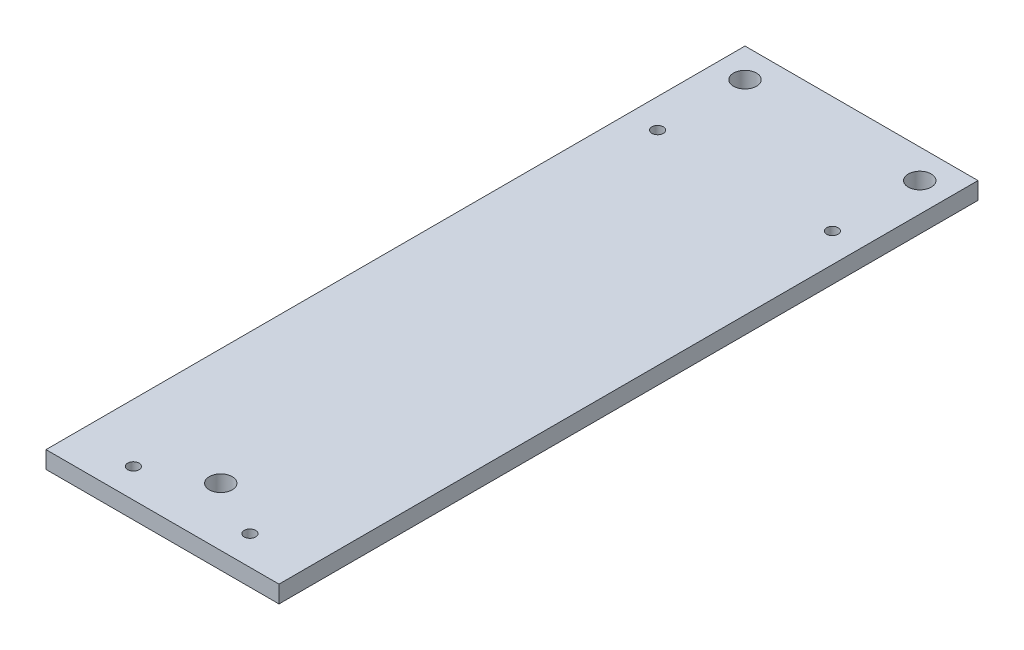
ISO-10303-21;
HEADER;
FILE_DESCRIPTION(('STEP AP214'),'2;1');
FILE_NAME('part.step','',(''),(''),'','','');
FILE_SCHEMA(('AUTOMOTIVE_DESIGN { 1 0 10303 214 1 1 1 1 }'));
ENDSEC;
DATA;
#1=APPLICATION_CONTEXT('core data for automotive mechanical design processes');
#2=APPLICATION_PROTOCOL_DEFINITION('international standard','automotive_design',2000,#1);
#3=PRODUCT_CONTEXT('',#1,'mechanical');
#4=PRODUCT('Part','Part','',(#3));
#5=PRODUCT_RELATED_PRODUCT_CATEGORY('part','',(#4));
#6=PRODUCT_DEFINITION_FORMATION('','',#4);
#7=PRODUCT_DEFINITION_CONTEXT('part definition',#1,'design');
#8=PRODUCT_DEFINITION('design','',#6,#7);
#9=PRODUCT_DEFINITION_SHAPE('','',#8);
#10=(LENGTH_UNIT() NAMED_UNIT(*) SI_UNIT(.MILLI.,.METRE.));
#11=(NAMED_UNIT(*) PLANE_ANGLE_UNIT() SI_UNIT($,.RADIAN.));
#12=(NAMED_UNIT(*) SI_UNIT($,.STERADIAN.) SOLID_ANGLE_UNIT());
#13=UNCERTAINTY_MEASURE_WITH_UNIT(LENGTH_MEASURE(1.E-05),#10,'distance_accuracy_value','');
#14=(GEOMETRIC_REPRESENTATION_CONTEXT(3) GLOBAL_UNCERTAINTY_ASSIGNED_CONTEXT((#13)) GLOBAL_UNIT_ASSIGNED_CONTEXT((#10,
#11,#12)) REPRESENTATION_CONTEXT('',''));
#15=CARTESIAN_POINT('',(0.,0.,0.));
#16=DIRECTION('',(0.,0.,1.));
#17=DIRECTION('',(1.,0.,0.));
#18=AXIS2_PLACEMENT_3D('',#15,#16,#17);
#19=CARTESIAN_POINT('',(45.72,1.5,0.));
#20=DIRECTION('',(1.,0.,0.));
#21=DIRECTION('',(0.,0.,-1.));
#22=AXIS2_PLACEMENT_3D('',#19,#20,#21);
#23=PLANE('',#22);
#24=DIRECTION('',(0.,0.,1.));
#25=VECTOR('',#24,1.);
#26=CARTESIAN_POINT('',(45.72,0.,0.));
#27=LINE('',#26,#25);
#28=CARTESIAN_POINT('',(45.72,0.,15.24));
#29=VERTEX_POINT('',#28);
#30=CARTESIAN_POINT('',(45.72,0.,76.2));
#31=VERTEX_POINT('',#30);
#32=EDGE_CURVE('E121',#29,#31,#27,.T.);
#33=ORIENTED_EDGE('',*,*,#32,.F.);
#34=DIRECTION('',(0.,-1.,0.));
#35=VECTOR('',#34,1.);
#36=CARTESIAN_POINT('',(45.72,1.5,15.24));
#37=LINE('',#36,#35);
#38=CARTESIAN_POINT('',(45.72,1.5,15.24));
#39=VERTEX_POINT('',#38);
#40=EDGE_CURVE('E11',#39,#29,#37,.T.);
#41=ORIENTED_EDGE('',*,*,#40,.F.);
#42=DIRECTION('',(0.,0.,1.));
#43=VECTOR('',#42,1.);
#44=CARTESIAN_POINT('',(45.72,1.5,0.));
#45=LINE('',#44,#43);
#46=CARTESIAN_POINT('',(45.72,1.5,76.2));
#47=VERTEX_POINT('',#46);
#48=EDGE_CURVE('E92',#39,#47,#45,.T.);
#49=ORIENTED_EDGE('',*,*,#48,.T.);
#50=DIRECTION('',(0.,-1.,0.));
#51=VECTOR('',#50,1.);
#52=CARTESIAN_POINT('',(45.72,1.5,76.2));
#53=LINE('',#52,#51);
#54=EDGE_CURVE('E52',#47,#31,#53,.T.);
#55=ORIENTED_EDGE('',*,*,#54,.T.);
#56=EDGE_LOOP('',(#33,#41,#49,#55));
#57=FACE_BOUND('',#56,.T.);
#58=ADVANCED_FACE('F35',(#57),#23,.T.);
#59=CARTESIAN_POINT('',(0.,1.5,15.24));
#60=DIRECTION('',(0.,0.,-1.));
#61=DIRECTION('',(-1.,0.,0.));
#62=AXIS2_PLACEMENT_3D('',#59,#60,#61);
#63=PLANE('',#62);
#64=DIRECTION('',(1.,0.,0.));
#65=VECTOR('',#64,1.);
#66=CARTESIAN_POINT('',(0.,0.,15.24));
#67=LINE('',#66,#65);
#68=CARTESIAN_POINT('',(25.4,0.,15.24));
#69=VERTEX_POINT('',#68);
#70=EDGE_CURVE('E82',#69,#29,#67,.T.);
#71=ORIENTED_EDGE('',*,*,#70,.F.);
#72=DIRECTION('',(0.,-1.,0.));
#73=VECTOR('',#72,1.);
#74=CARTESIAN_POINT('',(25.4,1.5,15.24));
#75=LINE('',#74,#73);
#76=CARTESIAN_POINT('',(25.4,1.5,15.24));
#77=VERTEX_POINT('',#76);
#78=EDGE_CURVE('E44',#77,#69,#75,.T.);
#79=ORIENTED_EDGE('',*,*,#78,.F.);
#80=DIRECTION('',(1.,0.,0.));
#81=VECTOR('',#80,1.);
#82=CARTESIAN_POINT('',(0.,1.5,15.24));
#83=LINE('',#82,#81);
#84=EDGE_CURVE('E80',#77,#39,#83,.T.);
#85=ORIENTED_EDGE('',*,*,#84,.T.);
#86=ORIENTED_EDGE('',*,*,#40,.T.);
#87=EDGE_LOOP('',(#71,#79,#85,#86));
#88=FACE_BOUND('',#87,.T.);
#89=ADVANCED_FACE('F79',(#88),#63,.T.);
#90=CARTESIAN_POINT('',(25.4,1.5,0.));
#91=DIRECTION('',(-1.,0.,0.));
#92=DIRECTION('',(0.,0.,1.));
#93=AXIS2_PLACEMENT_3D('',#90,#91,#92);
#94=PLANE('',#93);
#95=DIRECTION('',(0.,0.,-1.));
#96=VECTOR('',#95,1.);
#97=CARTESIAN_POINT('',(25.4,0.,0.));
#98=LINE('',#97,#96);
#99=CARTESIAN_POINT('',(25.4,0.,76.2));
#100=VERTEX_POINT('',#99);
#101=EDGE_CURVE('E124',#100,#69,#98,.T.);
#102=ORIENTED_EDGE('',*,*,#101,.F.);
#103=DIRECTION('',(0.,-1.,0.));
#104=VECTOR('',#103,1.);
#105=CARTESIAN_POINT('',(25.4,1.5,76.2));
#106=LINE('',#105,#104);
#107=CARTESIAN_POINT('',(25.4,1.5,76.2));
#108=VERTEX_POINT('',#107);
#109=EDGE_CURVE('E65',#108,#100,#106,.T.);
#110=ORIENTED_EDGE('',*,*,#109,.F.);
#111=DIRECTION('',(0.,0.,-1.));
#112=VECTOR('',#111,1.);
#113=CARTESIAN_POINT('',(25.4,1.5,0.));
#114=LINE('',#113,#112);
#115=EDGE_CURVE('E91',#108,#77,#114,.T.);
#116=ORIENTED_EDGE('',*,*,#115,.T.);
#117=ORIENTED_EDGE('',*,*,#78,.T.);
#118=EDGE_LOOP('',(#102,#110,#116,#117));
#119=FACE_BOUND('',#118,.T.);
#120=ADVANCED_FACE('F94',(#119),#94,.T.);
#121=CARTESIAN_POINT('',(30.48,1.5,73.66));
#122=DIRECTION('',(0.,-1.,0.));
#123=DIRECTION('',(0.,0.,-1.));
#124=AXIS2_PLACEMENT_3D('',#121,#122,#123);
#125=CYLINDRICAL_SURFACE('',#124,0.499999999999999);
#126=CARTESIAN_POINT('',(30.48,1.5,73.66));
#127=DIRECTION('',(0.,1.,0.));
#128=DIRECTION('',(0.,0.,1.));
#129=AXIS2_PLACEMENT_3D('',#126,#127,#128);
#130=CIRCLE('',#129,0.499999999999999);
#131=CARTESIAN_POINT('',(30.48,1.5,74.16));
#132=VERTEX_POINT('',#131);
#133=EDGE_CURVE('E106',#132,#132,#130,.T.);
#134=ORIENTED_EDGE('',*,*,#133,.T.);
#135=EDGE_LOOP('',(#134));
#136=FACE_BOUND('',#135,.T.);
#137=CARTESIAN_POINT('',(30.48,0.,73.66));
#138=DIRECTION('',(0.,1.,0.));
#139=DIRECTION('',(0.,0.,1.));
#140=AXIS2_PLACEMENT_3D('',#137,#138,#139);
#141=CIRCLE('',#140,0.499999999999999);
#142=CARTESIAN_POINT('',(30.48,0.,74.16));
#143=VERTEX_POINT('',#142);
#144=EDGE_CURVE('E135',#143,#143,#141,.T.);
#145=ORIENTED_EDGE('',*,*,#144,.F.);
#146=EDGE_LOOP('',(#145));
#147=FACE_BOUND('',#146,.T.);
#148=ADVANCED_FACE('F203',(#136,#147),#125,.F.);
#149=CARTESIAN_POINT('',(27.94,1.5,25.4));
#150=DIRECTION('',(0.,-1.,0.));
#151=DIRECTION('',(0.,0.,-1.));
#152=AXIS2_PLACEMENT_3D('',#149,#150,#151);
#153=CYLINDRICAL_SURFACE('',#152,0.499999999999999);
#154=CARTESIAN_POINT('',(27.94,1.5,25.4));
#155=DIRECTION('',(0.,1.,0.));
#156=DIRECTION('',(0.,0.,1.));
#157=AXIS2_PLACEMENT_3D('',#154,#155,#156);
#158=CIRCLE('',#157,0.499999999999999);
#159=CARTESIAN_POINT('',(27.94,1.5,25.9));
#160=VERTEX_POINT('',#159);
#161=EDGE_CURVE('E103',#160,#160,#158,.F.);
#162=ORIENTED_EDGE('',*,*,#161,.F.);
#163=EDGE_LOOP('',(#162));
#164=FACE_BOUND('',#163,.T.);
#165=CARTESIAN_POINT('',(27.94,0.,25.4));
#166=DIRECTION('',(0.,1.,0.));
#167=DIRECTION('',(0.,0.,1.));
#168=AXIS2_PLACEMENT_3D('',#165,#166,#167);
#169=CIRCLE('',#168,0.499999999999999);
#170=CARTESIAN_POINT('',(27.94,0.,25.9));
#171=VERTEX_POINT('',#170);
#172=EDGE_CURVE('E132',#171,#171,#169,.F.);
#173=ORIENTED_EDGE('',*,*,#172,.T.);
#174=EDGE_LOOP('',(#173));
#175=FACE_BOUND('',#174,.T.);
#176=ADVANCED_FACE('F167',(#164,#175),#153,.F.);
#177=CARTESIAN_POINT('',(27.94,1.5,17.78));
#178=DIRECTION('',(0.,-1.,0.));
#179=DIRECTION('',(0.,0.,-1.));
#180=AXIS2_PLACEMENT_3D('',#177,#178,#179);
#181=CYLINDRICAL_SURFACE('',#180,0.999999999999998);
#182=CARTESIAN_POINT('',(27.94,1.5,17.78));
#183=DIRECTION('',(0.,1.,0.));
#184=DIRECTION('',(0.,0.,1.));
#185=AXIS2_PLACEMENT_3D('',#182,#183,#184);
#186=CIRCLE('',#185,0.999999999999998);
#187=CARTESIAN_POINT('',(27.94,1.5,18.78));
#188=VERTEX_POINT('',#187);
#189=EDGE_CURVE('E97',#188,#188,#186,.T.);
#190=ORIENTED_EDGE('',*,*,#189,.T.);
#191=EDGE_LOOP('',(#190));
#192=FACE_BOUND('',#191,.T.);
#193=CARTESIAN_POINT('',(27.94,0.,17.78));
#194=DIRECTION('',(0.,1.,0.));
#195=DIRECTION('',(0.,0.,1.));
#196=AXIS2_PLACEMENT_3D('',#193,#194,#195);
#197=CIRCLE('',#196,0.999999999999998);
#198=CARTESIAN_POINT('',(27.94,0.,18.78));
#199=VERTEX_POINT('',#198);
#200=EDGE_CURVE('E129',#199,#199,#197,.T.);
#201=ORIENTED_EDGE('',*,*,#200,.F.);
#202=EDGE_LOOP('',(#201));
#203=FACE_BOUND('',#202,.T.);
#204=ADVANCED_FACE('F158',(#192,#203),#181,.F.);
#205=CARTESIAN_POINT('',(0.,1.5,76.2));
#206=DIRECTION('',(0.,0.,1.));
#207=DIRECTION('',(1.,0.,0.));
#208=AXIS2_PLACEMENT_3D('',#205,#206,#207);
#209=PLANE('',#208);
#210=DIRECTION('',(-1.,0.,0.));
#211=VECTOR('',#210,1.);
#212=CARTESIAN_POINT('',(0.,0.,76.2));
#213=LINE('',#212,#211);
#214=EDGE_CURVE('E126',#31,#100,#213,.T.);
#215=ORIENTED_EDGE('',*,*,#214,.F.);
#216=ORIENTED_EDGE('',*,*,#54,.F.);
#217=DIRECTION('',(-1.,0.,0.));
#218=VECTOR('',#217,1.);
#219=CARTESIAN_POINT('',(0.,1.5,76.2));
#220=LINE('',#219,#218);
#221=EDGE_CURVE('E95',#47,#108,#220,.T.);
#222=ORIENTED_EDGE('',*,*,#221,.T.);
#223=ORIENTED_EDGE('',*,*,#109,.T.);
#224=EDGE_LOOP('',(#215,#216,#222,#223));
#225=FACE_BOUND('',#224,.T.);
#226=ADVANCED_FACE('F155',(#225),#209,.T.);
#227=CARTESIAN_POINT('',(35.5600000000001,1.5,71.12));
#228=DIRECTION('',(0.,-1.,0.));
#229=DIRECTION('',(0.,0.,-1.));
#230=AXIS2_PLACEMENT_3D('',#227,#228,#229);
#231=CYLINDRICAL_SURFACE('',#230,0.999999999999998);
#232=CARTESIAN_POINT('',(35.5600000000001,1.5,71.12));
#233=DIRECTION('',(0.,1.,0.));
#234=DIRECTION('',(0.,0.,1.));
#235=AXIS2_PLACEMENT_3D('',#232,#233,#234);
#236=CIRCLE('',#235,0.999999999999998);
#237=CARTESIAN_POINT('',(35.5600000000001,1.5,72.12));
#238=VERTEX_POINT('',#237);
#239=EDGE_CURVE('E151',#238,#238,#236,.F.);
#240=ORIENTED_EDGE('',*,*,#239,.F.);
#241=EDGE_LOOP('',(#240));
#242=FACE_BOUND('',#241,.T.);
#243=CARTESIAN_POINT('',(35.5600000000001,0.,71.12));
#244=DIRECTION('',(0.,1.,0.));
#245=DIRECTION('',(0.,0.,1.));
#246=AXIS2_PLACEMENT_3D('',#243,#244,#245);
#247=CIRCLE('',#246,0.999999999999998);
#248=CARTESIAN_POINT('',(35.5600000000001,0.,72.12));
#249=VERTEX_POINT('',#248);
#250=EDGE_CURVE('E118',#249,#249,#247,.F.);
#251=ORIENTED_EDGE('',*,*,#250,.T.);
#252=EDGE_LOOP('',(#251));
#253=FACE_BOUND('',#252,.T.);
#254=ADVANCED_FACE('F157',(#242,#253),#231,.F.);
#255=CARTESIAN_POINT('',(43.18,1.5,25.4));
#256=DIRECTION('',(0.,-1.,0.));
#257=DIRECTION('',(0.,0.,-1.));
#258=AXIS2_PLACEMENT_3D('',#255,#256,#257);
#259=CYLINDRICAL_SURFACE('',#258,0.499999999999999);
#260=CARTESIAN_POINT('',(43.18,1.5,25.4));
#261=DIRECTION('',(0.,1.,0.));
#262=DIRECTION('',(0.,0.,1.));
#263=AXIS2_PLACEMENT_3D('',#260,#261,#262);
#264=CIRCLE('',#263,0.499999999999999);
#265=CARTESIAN_POINT('',(43.18,1.5,25.9));
#266=VERTEX_POINT('',#265);
#267=EDGE_CURVE('E146',#266,#266,#264,.T.);
#268=ORIENTED_EDGE('',*,*,#267,.T.);
#269=EDGE_LOOP('',(#268));
#270=FACE_BOUND('',#269,.T.);
#271=CARTESIAN_POINT('',(43.18,0.,25.4));
#272=DIRECTION('',(0.,1.,0.));
#273=DIRECTION('',(0.,0.,1.));
#274=AXIS2_PLACEMENT_3D('',#271,#272,#273);
#275=CIRCLE('',#274,0.499999999999999);
#276=CARTESIAN_POINT('',(43.18,0.,25.9));
#277=VERTEX_POINT('',#276);
#278=EDGE_CURVE('E115',#277,#277,#275,.T.);
#279=ORIENTED_EDGE('',*,*,#278,.F.);
#280=EDGE_LOOP('',(#279));
#281=FACE_BOUND('',#280,.T.);
#282=ADVANCED_FACE('F164',(#270,#281),#259,.F.);
#283=CARTESIAN_POINT('',(43.18,1.5,17.78));
#284=DIRECTION('',(0.,-1.,0.));
#285=DIRECTION('',(0.,0.,-1.));
#286=AXIS2_PLACEMENT_3D('',#283,#284,#285);
#287=CYLINDRICAL_SURFACE('',#286,1.00000000000001);
#288=CARTESIAN_POINT('',(43.18,1.5,17.78));
#289=DIRECTION('',(0.,1.,0.));
#290=DIRECTION('',(0.,0.,1.));
#291=AXIS2_PLACEMENT_3D('',#288,#289,#290);
#292=CIRCLE('',#291,1.00000000000001);
#293=CARTESIAN_POINT('',(43.18,1.5,18.78));
#294=VERTEX_POINT('',#293);
#295=EDGE_CURVE('E141',#294,#294,#292,.F.);
#296=ORIENTED_EDGE('',*,*,#295,.F.);
#297=EDGE_LOOP('',(#296));
#298=FACE_BOUND('',#297,.T.);
#299=CARTESIAN_POINT('',(43.18,0.,17.78));
#300=DIRECTION('',(0.,1.,0.));
#301=DIRECTION('',(0.,0.,1.));
#302=AXIS2_PLACEMENT_3D('',#299,#300,#301);
#303=CIRCLE('',#302,1.00000000000001);
#304=CARTESIAN_POINT('',(43.18,0.,18.78));
#305=VERTEX_POINT('',#304);
#306=EDGE_CURVE('E112',#305,#305,#303,.F.);
#307=ORIENTED_EDGE('',*,*,#306,.T.);
#308=EDGE_LOOP('',(#307));
#309=FACE_BOUND('',#308,.T.);
#310=ADVANCED_FACE('F37',(#298,#309),#287,.F.);
#311=CARTESIAN_POINT('',(40.64,1.5,73.66));
#312=DIRECTION('',(0.,-1.,0.));
#313=DIRECTION('',(0.,0.,-1.));
#314=AXIS2_PLACEMENT_3D('',#311,#312,#313);
#315=CYLINDRICAL_SURFACE('',#314,0.499999999999999);
#316=CARTESIAN_POINT('',(40.64,1.5,73.66));
#317=DIRECTION('',(0.,1.,0.));
#318=DIRECTION('',(0.,0.,1.));
#319=AXIS2_PLACEMENT_3D('',#316,#317,#318);
#320=CIRCLE('',#319,0.499999999999999);
#321=CARTESIAN_POINT('',(40.64,1.5,74.16));
#322=VERTEX_POINT('',#321);
#323=EDGE_CURVE('E109',#322,#322,#320,.F.);
#324=ORIENTED_EDGE('',*,*,#323,.F.);
#325=EDGE_LOOP('',(#324));
#326=FACE_BOUND('',#325,.T.);
#327=CARTESIAN_POINT('',(40.64,0.,73.66));
#328=DIRECTION('',(0.,1.,0.));
#329=DIRECTION('',(0.,0.,1.));
#330=AXIS2_PLACEMENT_3D('',#327,#328,#329);
#331=CIRCLE('',#330,0.499999999999999);
#332=CARTESIAN_POINT('',(40.64,0.,74.16));
#333=VERTEX_POINT('',#332);
#334=EDGE_CURVE('E138',#333,#333,#331,.F.);
#335=ORIENTED_EDGE('',*,*,#334,.T.);
#336=EDGE_LOOP('',(#335));
#337=FACE_BOUND('',#336,.T.);
#338=ADVANCED_FACE('F182',(#326,#337),#315,.F.);
#339=CARTESIAN_POINT('',(0.,1.5,0.));
#340=DIRECTION('',(0.,1.,0.));
#341=DIRECTION('',(0.,0.,1.));
#342=AXIS2_PLACEMENT_3D('',#339,#340,#341);
#343=PLANE('',#342);
#344=ORIENTED_EDGE('',*,*,#295,.T.);
#345=EDGE_LOOP('',(#344));
#346=FACE_BOUND('',#345,.T.);
#347=ORIENTED_EDGE('',*,*,#267,.F.);
#348=EDGE_LOOP('',(#347));
#349=FACE_BOUND('',#348,.T.);
#350=ORIENTED_EDGE('',*,*,#239,.T.);
#351=EDGE_LOOP('',(#350));
#352=FACE_BOUND('',#351,.T.);
#353=ORIENTED_EDGE('',*,*,#48,.F.);
#354=ORIENTED_EDGE('',*,*,#84,.F.);
#355=ORIENTED_EDGE('',*,*,#115,.F.);
#356=ORIENTED_EDGE('',*,*,#221,.F.);
#357=EDGE_LOOP('',(#353,#354,#355,#356));
#358=FACE_BOUND('',#357,.T.);
#359=ORIENTED_EDGE('',*,*,#189,.F.);
#360=EDGE_LOOP('',(#359));
#361=FACE_BOUND('',#360,.T.);
#362=ORIENTED_EDGE('',*,*,#161,.T.);
#363=EDGE_LOOP('',(#362));
#364=FACE_BOUND('',#363,.T.);
#365=ORIENTED_EDGE('',*,*,#133,.F.);
#366=EDGE_LOOP('',(#365));
#367=FACE_BOUND('',#366,.T.);
#368=ORIENTED_EDGE('',*,*,#323,.T.);
#369=EDGE_LOOP('',(#368));
#370=FACE_BOUND('',#369,.T.);
#371=ADVANCED_FACE('F88',(#346,#349,#352,#358,#361,#364,#367,#370),#343,.T.);
#372=CARTESIAN_POINT('',(0.,0.,0.));
#373=DIRECTION('',(0.,1.,0.));
#374=DIRECTION('',(0.,0.,1.));
#375=AXIS2_PLACEMENT_3D('',#372,#373,#374);
#376=PLANE('',#375);
#377=ORIENTED_EDGE('',*,*,#306,.F.);
#378=EDGE_LOOP('',(#377));
#379=FACE_BOUND('',#378,.T.);
#380=ORIENTED_EDGE('',*,*,#278,.T.);
#381=EDGE_LOOP('',(#380));
#382=FACE_BOUND('',#381,.T.);
#383=ORIENTED_EDGE('',*,*,#250,.F.);
#384=EDGE_LOOP('',(#383));
#385=FACE_BOUND('',#384,.T.);
#386=ORIENTED_EDGE('',*,*,#32,.T.);
#387=ORIENTED_EDGE('',*,*,#214,.T.);
#388=ORIENTED_EDGE('',*,*,#101,.T.);
#389=ORIENTED_EDGE('',*,*,#70,.T.);
#390=EDGE_LOOP('',(#386,#387,#388,#389));
#391=FACE_BOUND('',#390,.T.);
#392=ORIENTED_EDGE('',*,*,#200,.T.);
#393=EDGE_LOOP('',(#392));
#394=FACE_BOUND('',#393,.T.);
#395=ORIENTED_EDGE('',*,*,#172,.F.);
#396=EDGE_LOOP('',(#395));
#397=FACE_BOUND('',#396,.T.);
#398=ORIENTED_EDGE('',*,*,#144,.T.);
#399=EDGE_LOOP('',(#398));
#400=FACE_BOUND('',#399,.T.);
#401=ORIENTED_EDGE('',*,*,#334,.F.);
#402=EDGE_LOOP('',(#401));
#403=FACE_BOUND('',#402,.T.);
#404=ADVANCED_FACE('F188',(#379,#382,#385,#391,#394,#397,#400,#403),#376,.F.);
#405=CLOSED_SHELL('',(#58,#89,#120,#148,#176,#204,#226,#254,#282,#310,#338,#371,#404));
#406=MANIFOLD_SOLID_BREP('B2',#405);
#407=ADVANCED_BREP_SHAPE_REPRESENTATION('',(#18,#406),#14);
#408=SHAPE_DEFINITION_REPRESENTATION(#9,#407);
ENDSEC;
END-ISO-10303-21;
